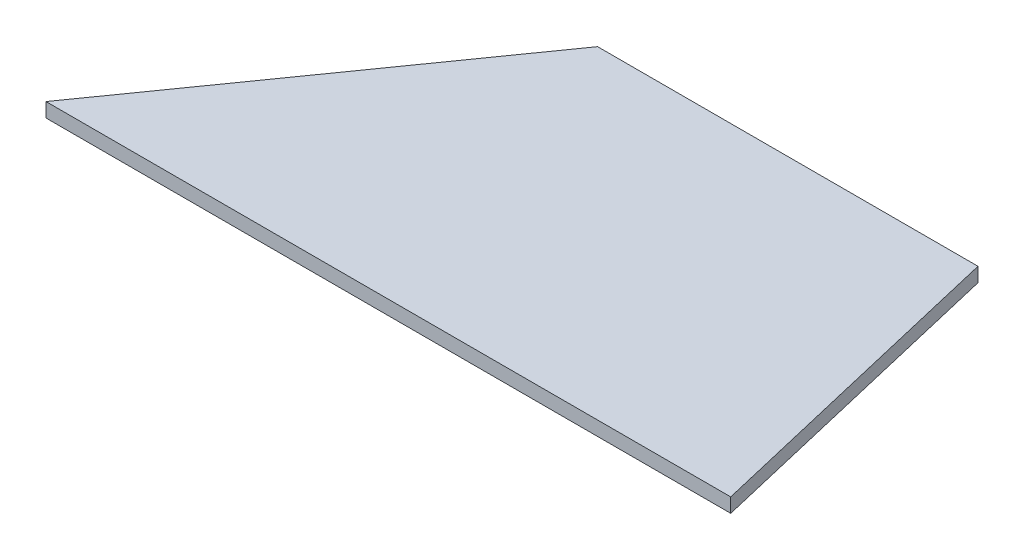
ISO-10303-21;
HEADER;
FILE_DESCRIPTION(('STEP AP214'),'2;1');
FILE_NAME('part.step','',(''),(''),'','','');
FILE_SCHEMA(('AUTOMOTIVE_DESIGN { 1 0 10303 214 1 1 1 1 }'));
ENDSEC;
DATA;
#1=APPLICATION_CONTEXT('core data for automotive mechanical design processes');
#2=APPLICATION_PROTOCOL_DEFINITION('international standard','automotive_design',2000,#1);
#3=PRODUCT_CONTEXT('',#1,'mechanical');
#4=PRODUCT('Part','Part','',(#3));
#5=PRODUCT_RELATED_PRODUCT_CATEGORY('part','',(#4));
#6=PRODUCT_DEFINITION_FORMATION('','',#4);
#7=PRODUCT_DEFINITION_CONTEXT('part definition',#1,'design');
#8=PRODUCT_DEFINITION('design','',#6,#7);
#9=PRODUCT_DEFINITION_SHAPE('','',#8);
#10=(LENGTH_UNIT() NAMED_UNIT(*) SI_UNIT(.MILLI.,.METRE.));
#11=(NAMED_UNIT(*) PLANE_ANGLE_UNIT() SI_UNIT($,.RADIAN.));
#12=(NAMED_UNIT(*) SI_UNIT($,.STERADIAN.) SOLID_ANGLE_UNIT());
#13=UNCERTAINTY_MEASURE_WITH_UNIT(LENGTH_MEASURE(1.E-05),#10,'distance_accuracy_value','');
#14=(GEOMETRIC_REPRESENTATION_CONTEXT(3) GLOBAL_UNCERTAINTY_ASSIGNED_CONTEXT((#13)) GLOBAL_UNIT_ASSIGNED_CONTEXT((#10,
#11,#12)) REPRESENTATION_CONTEXT('',''));
#15=CARTESIAN_POINT('',(0.,0.,0.));
#16=DIRECTION('',(0.,0.,1.));
#17=DIRECTION('',(1.,0.,0.));
#18=AXIS2_PLACEMENT_3D('',#15,#16,#17);
#19=CARTESIAN_POINT('',(0.,4.7625,0.));
#20=DIRECTION('',(0.,0.,-1.));
#21=DIRECTION('',(-1.,0.,0.));
#22=AXIS2_PLACEMENT_3D('',#19,#20,#21);
#23=PLANE('',#22);
#24=DIRECTION('',(1.,0.,0.));
#25=VECTOR('',#24,1.);
#26=CARTESIAN_POINT('',(0.,0.,0.));
#27=LINE('',#26,#25);
#28=CARTESIAN_POINT('',(0.,0.,0.));
#29=VERTEX_POINT('',#28);
#30=CARTESIAN_POINT('',(228.6,0.,0.));
#31=VERTEX_POINT('',#30);
#32=EDGE_CURVE('E99',#29,#31,#27,.T.);
#33=ORIENTED_EDGE('',*,*,#32,.T.);
#34=DIRECTION('',(0.,-1.,0.));
#35=VECTOR('',#34,1.);
#36=CARTESIAN_POINT('',(228.6,4.7625,0.));
#37=LINE('',#36,#35);
#38=CARTESIAN_POINT('',(228.6,4.7625,0.));
#39=VERTEX_POINT('',#38);
#40=EDGE_CURVE('E11',#39,#31,#37,.T.);
#41=ORIENTED_EDGE('',*,*,#40,.F.);
#42=DIRECTION('',(1.,0.,0.));
#43=VECTOR('',#42,1.);
#44=CARTESIAN_POINT('',(0.,4.7625,0.));
#45=LINE('',#44,#43);
#46=CARTESIAN_POINT('',(0.,4.7625,0.));
#47=VERTEX_POINT('',#46);
#48=EDGE_CURVE('E87',#47,#39,#45,.T.);
#49=ORIENTED_EDGE('',*,*,#48,.F.);
#50=DIRECTION('',(0.,-1.,0.));
#51=VECTOR('',#50,1.);
#52=CARTESIAN_POINT('',(0.,4.7625,0.));
#53=LINE('',#52,#51);
#54=EDGE_CURVE('E95',#47,#29,#53,.T.);
#55=ORIENTED_EDGE('',*,*,#54,.T.);
#56=EDGE_LOOP('',(#33,#41,#49,#55));
#57=FACE_BOUND('',#56,.T.);
#58=ADVANCED_FACE('F36',(#57),#23,.F.);
#59=CARTESIAN_POINT('',(228.6,4.7625,0.));
#60=DIRECTION('',(-0.973417168333576,0.,0.229039333725547));
#61=DIRECTION('',(0.229039333725547,0.,0.973417168333576));
#62=AXIS2_PLACEMENT_3D('',#59,#60,#61);
#63=PLANE('',#62);
#64=DIRECTION('',(-0.229039333725547,0.,-0.973417168333576));
#65=VECTOR('',#64,1.);
#66=CARTESIAN_POINT('',(228.6,0.,0.));
#67=LINE('',#66,#65);
#68=CARTESIAN_POINT('',(203.2,0.,-107.95));
#69=VERTEX_POINT('',#68);
#70=EDGE_CURVE('E91',#31,#69,#67,.T.);
#71=ORIENTED_EDGE('',*,*,#70,.T.);
#72=DIRECTION('',(0.,-1.,0.));
#73=VECTOR('',#72,1.);
#74=CARTESIAN_POINT('',(203.2,4.7625,-107.95));
#75=LINE('',#74,#73);
#76=CARTESIAN_POINT('',(203.2,4.7625,-107.95));
#77=VERTEX_POINT('',#76);
#78=EDGE_CURVE('E44',#77,#69,#75,.T.);
#79=ORIENTED_EDGE('',*,*,#78,.F.);
#80=DIRECTION('',(-0.229039333725547,0.,-0.973417168333576));
#81=VECTOR('',#80,1.);
#82=CARTESIAN_POINT('',(228.6,4.7625,0.));
#83=LINE('',#82,#81);
#84=EDGE_CURVE('E82',#39,#77,#83,.T.);
#85=ORIENTED_EDGE('',*,*,#84,.F.);
#86=ORIENTED_EDGE('',*,*,#40,.T.);
#87=EDGE_LOOP('',(#71,#79,#85,#86));
#88=FACE_BOUND('',#87,.T.);
#89=ADVANCED_FACE('F90',(#88),#63,.F.);
#90=CARTESIAN_POINT('',(203.2,4.7625,-107.95));
#91=DIRECTION('',(0.,0.,1.));
#92=DIRECTION('',(1.,0.,0.));
#93=AXIS2_PLACEMENT_3D('',#90,#91,#92);
#94=PLANE('',#93);
#95=DIRECTION('',(-1.,0.,0.));
#96=VECTOR('',#95,1.);
#97=CARTESIAN_POINT('',(203.2,0.,-107.95));
#98=LINE('',#97,#96);
#99=CARTESIAN_POINT('',(76.2,0.,-107.95));
#100=VERTEX_POINT('',#99);
#101=EDGE_CURVE('E69',#69,#100,#98,.T.);
#102=ORIENTED_EDGE('',*,*,#101,.T.);
#103=DIRECTION('',(0.,-1.,0.));
#104=VECTOR('',#103,1.);
#105=CARTESIAN_POINT('',(76.2,4.7625,-107.95));
#106=LINE('',#105,#104);
#107=CARTESIAN_POINT('',(76.2,4.7625,-107.95));
#108=VERTEX_POINT('',#107);
#109=EDGE_CURVE('E92',#108,#100,#106,.T.);
#110=ORIENTED_EDGE('',*,*,#109,.F.);
#111=DIRECTION('',(-1.,0.,0.));
#112=VECTOR('',#111,1.);
#113=CARTESIAN_POINT('',(203.2,4.7625,-107.95));
#114=LINE('',#113,#112);
#115=EDGE_CURVE('E85',#77,#108,#114,.T.);
#116=ORIENTED_EDGE('',*,*,#115,.F.);
#117=ORIENTED_EDGE('',*,*,#78,.T.);
#118=EDGE_LOOP('',(#102,#110,#116,#117));
#119=FACE_BOUND('',#118,.T.);
#120=ADVANCED_FACE('F93',(#119),#94,.F.);
#121=CARTESIAN_POINT('',(76.2,4.7625,-107.95));
#122=DIRECTION('',(0.816967863264762,0.,0.576683197598655));
#123=DIRECTION('',(0.576683197598655,0.,-0.816967863264762));
#124=AXIS2_PLACEMENT_3D('',#121,#122,#123);
#125=PLANE('',#124);
#126=DIRECTION('',(-0.576683197598655,0.,0.816967863264762));
#127=VECTOR('',#126,1.);
#128=CARTESIAN_POINT('',(76.2,0.,-107.95));
#129=LINE('',#128,#127);
#130=EDGE_CURVE('E75',#100,#29,#129,.T.);
#131=ORIENTED_EDGE('',*,*,#130,.T.);
#132=ORIENTED_EDGE('',*,*,#54,.F.);
#133=DIRECTION('',(-0.576683197598655,0.,0.816967863264762));
#134=VECTOR('',#133,1.);
#135=CARTESIAN_POINT('',(76.2,4.7625,-107.95));
#136=LINE('',#135,#134);
#137=EDGE_CURVE('E52',#108,#47,#136,.T.);
#138=ORIENTED_EDGE('',*,*,#137,.F.);
#139=ORIENTED_EDGE('',*,*,#109,.T.);
#140=EDGE_LOOP('',(#131,#132,#138,#139));
#141=FACE_BOUND('',#140,.T.);
#142=ADVANCED_FACE('F106',(#141),#125,.F.);
#143=CARTESIAN_POINT('',(0.,4.7625,0.));
#144=DIRECTION('',(0.,1.,0.));
#145=DIRECTION('',(0.,0.,1.));
#146=AXIS2_PLACEMENT_3D('',#143,#144,#145);
#147=PLANE('',#146);
#148=ORIENTED_EDGE('',*,*,#48,.T.);
#149=ORIENTED_EDGE('',*,*,#84,.T.);
#150=ORIENTED_EDGE('',*,*,#115,.T.);
#151=ORIENTED_EDGE('',*,*,#137,.T.);
#152=EDGE_LOOP('',(#148,#149,#150,#151));
#153=FACE_BOUND('',#152,.T.);
#154=ADVANCED_FACE('F83',(#153),#147,.T.);
#155=CARTESIAN_POINT('',(0.,0.,0.));
#156=DIRECTION('',(0.,1.,0.));
#157=DIRECTION('',(0.,0.,1.));
#158=AXIS2_PLACEMENT_3D('',#155,#156,#157);
#159=PLANE('',#158);
#160=ORIENTED_EDGE('',*,*,#32,.F.);
#161=ORIENTED_EDGE('',*,*,#130,.F.);
#162=ORIENTED_EDGE('',*,*,#101,.F.);
#163=ORIENTED_EDGE('',*,*,#70,.F.);
#164=EDGE_LOOP('',(#160,#161,#162,#163));
#165=FACE_BOUND('',#164,.T.);
#166=ADVANCED_FACE('F109',(#165),#159,.F.);
#167=CLOSED_SHELL('',(#58,#89,#120,#142,#154,#166));
#168=MANIFOLD_SOLID_BREP('B2',#167);
#169=ADVANCED_BREP_SHAPE_REPRESENTATION('',(#18,#168),#14);
#170=SHAPE_DEFINITION_REPRESENTATION(#9,#169);
ENDSEC;
END-ISO-10303-21;
